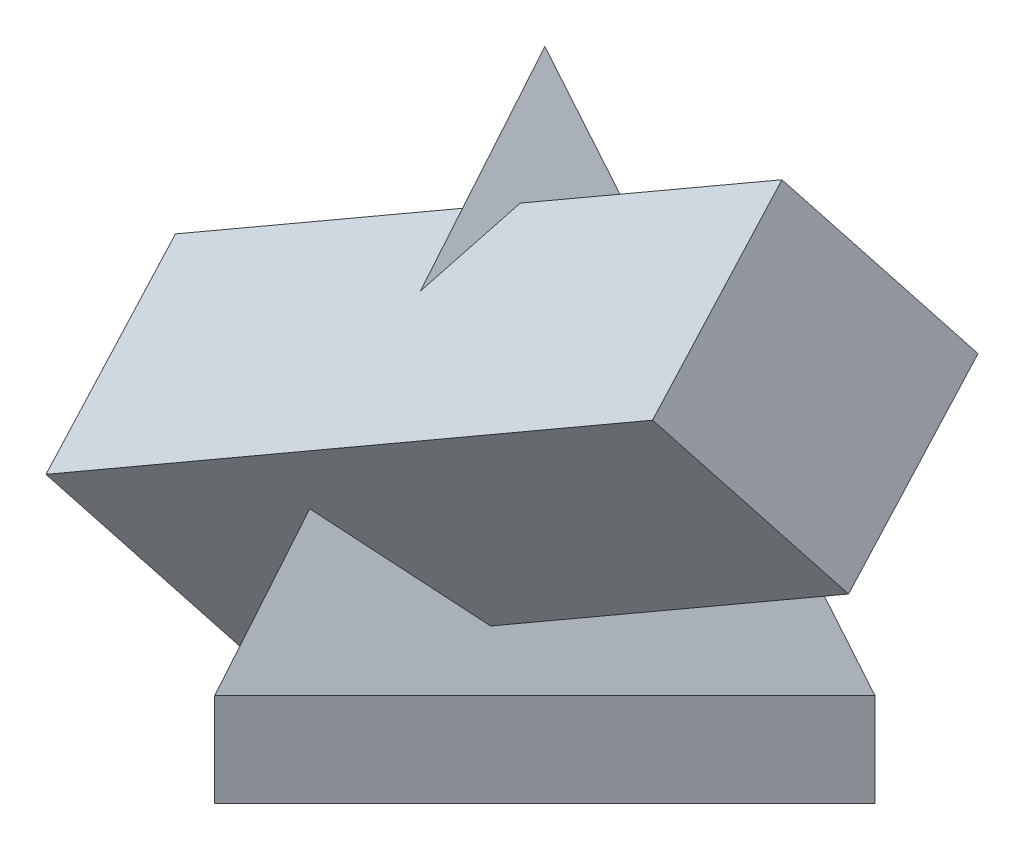
ISO-10303-21;
HEADER;
FILE_DESCRIPTION(('STEP AP214'),'2;1');
FILE_NAME('part.step','',(''),(''),'','','');
FILE_SCHEMA(('AUTOMOTIVE_DESIGN { 1 0 10303 214 1 1 1 1 }'));
ENDSEC;
DATA;
#1=APPLICATION_CONTEXT('core data for automotive mechanical design processes');
#2=APPLICATION_PROTOCOL_DEFINITION('international standard','automotive_design',2000,#1);
#3=PRODUCT_CONTEXT('',#1,'mechanical');
#4=PRODUCT('Part','Part','',(#3));
#5=PRODUCT_RELATED_PRODUCT_CATEGORY('part','',(#4));
#6=PRODUCT_DEFINITION_FORMATION('','',#4);
#7=PRODUCT_DEFINITION_CONTEXT('part definition',#1,'design');
#8=PRODUCT_DEFINITION('design','',#6,#7);
#9=PRODUCT_DEFINITION_SHAPE('','',#8);
#10=(LENGTH_UNIT() NAMED_UNIT(*) SI_UNIT(.MILLI.,.METRE.));
#11=(NAMED_UNIT(*) PLANE_ANGLE_UNIT() SI_UNIT($,.RADIAN.));
#12=(NAMED_UNIT(*) SI_UNIT($,.STERADIAN.) SOLID_ANGLE_UNIT());
#13=UNCERTAINTY_MEASURE_WITH_UNIT(LENGTH_MEASURE(1.E-05),#10,'distance_accuracy_value','');
#14=(GEOMETRIC_REPRESENTATION_CONTEXT(3) GLOBAL_UNCERTAINTY_ASSIGNED_CONTEXT((#13)) GLOBAL_UNIT_ASSIGNED_CONTEXT((#10,
#11,#12)) REPRESENTATION_CONTEXT('',''));
#15=CARTESIAN_POINT('',(0.,0.,0.));
#16=DIRECTION('',(0.,0.,1.));
#17=DIRECTION('',(1.,0.,0.));
#18=AXIS2_PLACEMENT_3D('',#15,#16,#17);
#19=CARTESIAN_POINT('',(25.881904510252,20.,96.5925826289068));
#20=DIRECTION('',(0.965925826289069,0.,-0.25881904510252));
#21=DIRECTION('',(-0.25881904510252,0.,-0.965925826289069));
#22=AXIS2_PLACEMENT_3D('',#19,#20,#21);
#23=PLANE('',#22);
#24=DIRECTION('',(0.11208878178138,0.901356545467851,0.418321028566611));
#25=VECTOR('',#24,1.);
#26=CARTESIAN_POINT('',(19.9794160731373,30.9574176679873,74.5641958905069));
#27=LINE('',#26,#25);
#28=CARTESIAN_POINT('',(17.377321752701,10.0328013917167,64.853047680552));
#29=VERTEX_POINT('',#28);
#30=CARTESIAN_POINT('',(18.6167992440367,20.,69.4788406530551));
#31=VERTEX_POINT('',#30);
#32=EDGE_CURVE('E202',#29,#31,#27,.T.);
#33=ORIENTED_EDGE('',*,*,#32,.F.);
#34=DIRECTION('',(0.23200098320511,-0.443280474379202,0.865839456727407));
#35=VECTOR('',#34,1.);
#36=CARTESIAN_POINT('',(23.185732873882,-1.06523449423572,86.5303330960477));
#37=LINE('',#36,#35);
#38=CARTESIAN_POINT('',(12.1607602062878,20.,45.3845749485279));
#39=VERTEX_POINT('',#38);
#40=EDGE_CURVE('E142',#39,#29,#37,.T.);
#41=ORIENTED_EDGE('',*,*,#40,.F.);
#42=DIRECTION('',(0.25881904510252,0.,0.965925826289068));
#43=VECTOR('',#42,1.);
#44=CARTESIAN_POINT('',(0.,20.,0.));
#45=LINE('',#44,#43);
#46=CARTESIAN_POINT('',(0.,20.,0.));
#47=VERTEX_POINT('',#46);
#48=EDGE_CURVE('E233',#47,#39,#45,.T.);
#49=ORIENTED_EDGE('',*,*,#48,.F.);
#50=DIRECTION('',(0.,-1.,0.));
#51=VECTOR('',#50,1.);
#52=CARTESIAN_POINT('',(0.,20.,0.));
#53=LINE('',#52,#51);
#54=CARTESIAN_POINT('',(0.,0.,0.));
#55=VERTEX_POINT('',#54);
#56=EDGE_CURVE('E222',#47,#55,#53,.T.);
#57=ORIENTED_EDGE('',*,*,#56,.T.);
#58=DIRECTION('',(0.25881904510252,0.,0.965925826289068));
#59=VECTOR('',#58,1.);
#60=CARTESIAN_POINT('',(25.881904510252,0.,96.5925826289068));
#61=LINE('',#60,#59);
#62=CARTESIAN_POINT('',(25.881904510252,0.,96.5925826289068));
#63=VERTEX_POINT('',#62);
#64=EDGE_CURVE('E207',#55,#63,#61,.T.);
#65=ORIENTED_EDGE('',*,*,#64,.T.);
#66=DIRECTION('',(0.,-1.,0.));
#67=VECTOR('',#66,1.);
#68=CARTESIAN_POINT('',(25.881904510252,20.,96.5925826289068));
#69=LINE('',#68,#67);
#70=CARTESIAN_POINT('',(25.881904510252,20.,96.5925826289068));
#71=VERTEX_POINT('',#70);
#72=EDGE_CURVE('E229',#71,#63,#69,.T.);
#73=ORIENTED_EDGE('',*,*,#72,.F.);
#74=EDGE_CURVE('E221',#31,#71,#45,.T.);
#75=ORIENTED_EDGE('',*,*,#74,.F.);
#76=EDGE_LOOP('',(#33,#41,#49,#57,#65,#73,#75));
#77=FACE_BOUND('',#76,.T.);
#78=ADVANCED_FACE('F35',(#77),#23,.F.);
#79=CARTESIAN_POINT('',(0.,20.,0.));
#80=DIRECTION('',(-0.928031515657931,0.277350098112615,0.248665295171173));
#81=DIRECTION('',(-0.286344323664977,-0.958126780914116,0.));
#82=AXIS2_PLACEMENT_3D('',#79,#80,#81);
#83=PLANE('',#82);
#84=DIRECTION('',(-0.129409522551261,-0.866025403784439,0.482962913144534));
#85=VECTOR('',#84,1.);
#86=CARTESIAN_POINT('',(40.8248290463863,120.,40.8248290463864));
#87=LINE('',#86,#85);
#88=CARTESIAN_POINT('',(30.1843202317546,48.7923271719581,80.5357485609762));
#89=VERTEX_POINT('',#88);
#90=EDGE_CURVE('E208',#89,#71,#87,.T.);
#91=ORIENTED_EDGE('',*,*,#90,.F.);
#92=DIRECTION('',(-0.35116663614666,-0.874077055105075,-0.335665451597688));
#93=VECTOR('',#92,1.);
#94=CARTESIAN_POINT('',(8.13122855256221,-6.09928110389285,59.4561236317736));
#95=LINE('',#94,#93);
#96=EDGE_CURVE('E199',#89,#31,#95,.T.);
#97=ORIENTED_EDGE('',*,*,#96,.T.);
#98=ORIENTED_EDGE('',*,*,#74,.T.);
#99=EDGE_LOOP('',(#91,#97,#98));
#100=FACE_BOUND('',#99,.T.);
#101=ADVANCED_FACE('F286',(#100),#83,.T.);
#102=ORIENTED_EDGE('',*,*,#48,.T.);
#103=DIRECTION('',(-0.0704392001564839,0.524849080779374,-0.848275757926844));
#104=VECTOR('',#103,1.);
#105=CARTESIAN_POINT('',(9.38860935813983,40.6555557303314,12.0004882954116));
#106=LINE('',#105,#104);
#107=CARTESIAN_POINT('',(10.5412956704333,32.0667820064651,25.8819045102521));
#108=VERTEX_POINT('',#107);
#109=EDGE_CURVE('E192',#39,#108,#106,.T.);
#110=ORIENTED_EDGE('',*,*,#109,.T.);
#111=DIRECTION('',(0.35116663614666,0.874077055105075,0.335665451597688));
#112=VECTOR('',#111,1.);
#113=CARTESIAN_POINT('',(2.48668845002809,12.0183302614663,18.1828434612117));
#114=LINE('',#113,#112);
#115=CARTESIAN_POINT('',(34.0803559928218,90.6570648200672,48.3819045102519));
#116=VERTEX_POINT('',#115);
#117=EDGE_CURVE('E186',#108,#116,#114,.T.);
#118=ORIENTED_EDGE('',*,*,#117,.T.);
#119=DIRECTION('',(0.0704392001564839,-0.524849080779374,0.848275757926844));
#120=VECTOR('',#119,1.);
#121=CARTESIAN_POINT('',(33.6325391853755,93.9937898144396,42.988996287203));
#122=LINE('',#121,#120);
#123=CARTESIAN_POINT('',(35.196930122335,82.3373663539413,61.8284337708078));
#124=VERTEX_POINT('',#123);
#125=EDGE_CURVE('E196',#116,#124,#122,.T.);
#126=ORIENTED_EDGE('',*,*,#125,.T.);
#127=CARTESIAN_POINT('',(40.8248290463863,120.,40.8248290463864));
#128=VERTEX_POINT('',#127);
#129=EDGE_CURVE('E204',#128,#124,#87,.T.);
#130=ORIENTED_EDGE('',*,*,#129,.F.);
#131=DIRECTION('',(-0.353553390593274,-0.866025403784438,-0.353553390593274));
#132=VECTOR('',#131,1.);
#133=CARTESIAN_POINT('',(40.8248290463863,120.,40.8248290463864));
#134=LINE('',#133,#132);
#135=EDGE_CURVE('E212',#128,#47,#134,.T.);
#136=ORIENTED_EDGE('',*,*,#135,.T.);
#137=EDGE_LOOP('',(#102,#110,#118,#126,#130,#136));
#138=FACE_BOUND('',#137,.T.);
#139=ADVANCED_FACE('F254',(#138),#83,.T.);
#140=CARTESIAN_POINT('',(25.881904510252,20.,96.5925826289069));
#141=DIRECTION('',(0.679366220486757,0.277350098112614,0.679366220486758));
#142=DIRECTION('',(0.707106781186548,0.,-0.707106781186547));
#143=AXIS2_PLACEMENT_3D('',#140,#141,#142);
#144=PLANE('',#143);
#145=DIRECTION('',(-0.383374556254765,-0.655264979104015,0.650885363774817));
#146=VECTOR('',#145,1.);
#147=CARTESIAN_POINT('',(38.6000461673175,5.71765669158888,89.7051832113182));
#148=LINE('',#147,#146);
#149=CARTESIAN_POINT('',(72.369252081888,63.4360880453524,32.372526368318));
#150=VERTEX_POINT('',#149);
#151=CARTESIAN_POINT('',(53.2380714807688,30.7370149005585,64.853047680552));
#152=VERTEX_POINT('',#151);
#153=EDGE_CURVE('E189',#150,#152,#148,.T.);
#154=ORIENTED_EDGE('',*,*,#153,.T.);
#155=DIRECTION('',(-0.694019696453443,0.543544614783883,0.472118536677084));
#156=VECTOR('',#155,1.);
#157=CARTESIAN_POINT('',(33.7121778956737,46.029368073324,78.135864225696));
#158=LINE('',#157,#156);
#159=EDGE_CURVE('E12',#152,#89,#158,.T.);
#160=ORIENTED_EDGE('',*,*,#159,.T.);
#161=ORIENTED_EDGE('',*,*,#90,.T.);
#162=DIRECTION('',(0.707106781186548,0.,-0.707106781186547));
#163=VECTOR('',#162,1.);
#164=CARTESIAN_POINT('',(25.881904510252,20.,96.5925826289069));
#165=LINE('',#164,#163);
#166=CARTESIAN_POINT('',(96.5925826289068,19.9999999999999,25.8819045102521));
#167=VERTEX_POINT('',#166);
#168=EDGE_CURVE('E236',#71,#167,#165,.T.);
#169=ORIENTED_EDGE('',*,*,#168,.T.);
#170=DIRECTION('',(0.482962913144534,-0.866025403784439,-0.12940952255126));
#171=VECTOR('',#170,1.);
#172=CARTESIAN_POINT('',(40.8248290463863,120.,40.8248290463864));
#173=LINE('',#172,#171);
#174=EDGE_CURVE('E57',#150,#167,#173,.T.);
#175=ORIENTED_EDGE('',*,*,#174,.F.);
#176=EDGE_LOOP('',(#154,#160,#161,#169,#175));
#177=FACE_BOUND('',#176,.T.);
#178=ADVANCED_FACE('F268',(#177),#144,.T.);
#179=DIRECTION('',(0.383374556254765,0.655264979104015,-0.650885363774817));
#180=VECTOR('',#179,1.);
#181=CARTESIAN_POINT('',(9.49315647576327,38.4043968163839,105.467767126088));
#182=LINE('',#181,#180);
#183=CARTESIAN_POINT('',(43.1169994238408,95.8743733375366,48.3819045102519));
#184=VERTEX_POINT('',#183);
#185=EDGE_CURVE('E42',#124,#184,#182,.T.);
#186=ORIENTED_EDGE('',*,*,#185,.T.);
#187=DIRECTION('',(0.694019696453444,-0.543544614783882,-0.472118536677084));
#188=VECTOR('',#187,1.);
#189=CARTESIAN_POINT('',(47.6409368903309,92.3313012027032,45.3044201857977));
#190=LINE('',#189,#188);
#191=CARTESIAN_POINT('',(62.9348804105811,80.3533405169743,34.9004586387397));
#192=VERTEX_POINT('',#191);
#193=EDGE_CURVE('E183',#184,#192,#190,.T.);
#194=ORIENTED_EDGE('',*,*,#193,.T.);
#195=EDGE_CURVE('E209',#128,#192,#173,.T.);
#196=ORIENTED_EDGE('',*,*,#195,.F.);
#197=ORIENTED_EDGE('',*,*,#129,.T.);
#198=EDGE_LOOP('',(#186,#194,#196,#197));
#199=FACE_BOUND('',#198,.T.);
#200=ADVANCED_FACE('F245',(#199),#144,.T.);
#201=CARTESIAN_POINT('',(96.5925826289068,20.,25.8819045102521));
#202=DIRECTION('',(0.248665295171174,0.277350098112615,-0.928031515657931));
#203=DIRECTION('',(0.,0.958126780914116,0.286344323664977));
#204=AXIS2_PLACEMENT_3D('',#201,#202,#203);
#205=PLANE('',#204);
#206=DIRECTION('',(-0.318511750690144,-0.88142616367329,-0.348766659336133));
#207=VECTOR('',#206,1.);
#208=CARTESIAN_POINT('',(48.4037339015588,40.1409066162794,18.9890223627014));
#209=LINE('',#208,#207);
#210=CARTESIAN_POINT('',(54.6986703622176,57.5610541714739,25.8819045102521));
#211=VERTEX_POINT('',#210);
#212=EDGE_CURVE('E232',#192,#211,#209,.T.);
#213=ORIENTED_EDGE('',*,*,#212,.T.);
#214=DIRECTION('',(0.896056550347519,0.297916767524538,0.3291325845416));
#215=VECTOR('',#214,1.);
#216=CARTESIAN_POINT('',(78.309085431027,65.4109365639238,34.5543001650614));
#217=LINE('',#216,#215);
#218=EDGE_CURVE('E242',#211,#150,#217,.T.);
#219=ORIENTED_EDGE('',*,*,#218,.T.);
#220=ORIENTED_EDGE('',*,*,#174,.T.);
#221=DIRECTION('',(-0.965925826289068,0.,-0.258819045102521));
#222=VECTOR('',#221,1.);
#223=CARTESIAN_POINT('',(96.5925826289069,20.,25.8819045102521));
#224=LINE('',#223,#222);
#225=EDGE_CURVE('E226',#167,#47,#224,.T.);
#226=ORIENTED_EDGE('',*,*,#225,.T.);
#227=ORIENTED_EDGE('',*,*,#135,.F.);
#228=ORIENTED_EDGE('',*,*,#195,.T.);
#229=EDGE_LOOP('',(#213,#219,#220,#226,#227,#228));
#230=FACE_BOUND('',#229,.T.);
#231=ADVANCED_FACE('F260',(#230),#205,.T.);
#232=CARTESIAN_POINT('',(96.5925826289068,20.,25.8819045102521));
#233=DIRECTION('',(-0.707106781186547,0.,-0.707106781186548));
#234=DIRECTION('',(-0.707106781186548,0.,0.707106781186547));
#235=AXIS2_PLACEMENT_3D('',#232,#233,#234);
#236=PLANE('',#235);
#237=DIRECTION('',(0.707106781186548,0.,-0.707106781186547));
#238=VECTOR('',#237,1.);
#239=CARTESIAN_POINT('',(96.5925826289068,0.,25.8819045102521));
#240=LINE('',#239,#238);
#241=CARTESIAN_POINT('',(96.5925826289068,0.,25.8819045102521));
#242=VERTEX_POINT('',#241);
#243=EDGE_CURVE('E217',#63,#242,#240,.T.);
#244=ORIENTED_EDGE('',*,*,#243,.T.);
#245=DIRECTION('',(0.,-1.,0.));
#246=VECTOR('',#245,1.);
#247=CARTESIAN_POINT('',(96.5925826289068,20.,25.8819045102521));
#248=LINE('',#247,#246);
#249=EDGE_CURVE('E225',#167,#242,#248,.T.);
#250=ORIENTED_EDGE('',*,*,#249,.F.);
#251=ORIENTED_EDGE('',*,*,#168,.F.);
#252=ORIENTED_EDGE('',*,*,#72,.T.);
#253=EDGE_LOOP('',(#244,#250,#251,#252));
#254=FACE_BOUND('',#253,.T.);
#255=ADVANCED_FACE('F272',(#254),#236,.F.);
#256=CARTESIAN_POINT('',(0.,20.,0.));
#257=DIRECTION('',(-0.258819045102521,0.,0.965925826289068));
#258=DIRECTION('',(0.965925826289068,0.,0.258819045102521));
#259=AXIS2_PLACEMENT_3D('',#256,#257,#258);
#260=PLANE('',#259);
#261=DIRECTION('',(-0.965925826289068,0.,-0.258819045102521));
#262=VECTOR('',#261,1.);
#263=CARTESIAN_POINT('',(0.,0.,0.));
#264=LINE('',#263,#262);
#265=EDGE_CURVE('E219',#242,#55,#264,.T.);
#266=ORIENTED_EDGE('',*,*,#265,.T.);
#267=ORIENTED_EDGE('',*,*,#56,.F.);
#268=ORIENTED_EDGE('',*,*,#225,.F.);
#269=ORIENTED_EDGE('',*,*,#249,.T.);
#270=EDGE_LOOP('',(#266,#267,#268,#269));
#271=FACE_BOUND('',#270,.T.);
#272=ADVANCED_FACE('F263',(#271),#260,.F.);
#273=CARTESIAN_POINT('',(25.881904510252,0.,96.5925826289069));
#274=DIRECTION('',(0.,1.,0.));
#275=DIRECTION('',(0.,0.,1.));
#276=AXIS2_PLACEMENT_3D('',#273,#274,#275);
#277=PLANE('',#276);
#278=ORIENTED_EDGE('',*,*,#64,.F.);
#279=ORIENTED_EDGE('',*,*,#265,.F.);
#280=ORIENTED_EDGE('',*,*,#243,.F.);
#281=EDGE_LOOP('',(#278,#279,#280));
#282=FACE_BOUND('',#281,.T.);
#283=ADVANCED_FACE('F275',(#282),#277,.F.);
#284=CARTESIAN_POINT('',(110.418238982516,108.75,87.3530476805518));
#285=DIRECTION('',(-0.249999999999998,0.433012701892215,-0.866025403784442));
#286=DIRECTION('',(0.,0.894427190999919,0.447213595499953));
#287=AXIS2_PLACEMENT_3D('',#284,#285,#286);
#288=PLANE('',#287);
#289=DIRECTION('',(-0.866025403784438,-0.500000000000001,0.));
#290=VECTOR('',#289,1.);
#291=CARTESIAN_POINT('',(129.903810567666,75.0000000000001,64.853047680552));
#292=LINE('',#291,#290);
#293=CARTESIAN_POINT('',(0.,0.,64.853047680552));
#294=VERTEX_POINT('',#293);
#295=EDGE_CURVE('E135',#29,#294,#292,.T.);
#296=ORIENTED_EDGE('',*,*,#295,.F.);
#297=ORIENTED_EDGE('',*,*,#32,.T.);
#298=ORIENTED_EDGE('',*,*,#96,.F.);
#299=ORIENTED_EDGE('',*,*,#159,.F.);
#300=CARTESIAN_POINT('',(129.903810567666,75.0000000000001,64.853047680552));
#301=VERTEX_POINT('',#300);
#302=EDGE_CURVE('E146',#301,#152,#292,.T.);
#303=ORIENTED_EDGE('',*,*,#302,.F.);
#304=DIRECTION('',(0.433012701892221,-0.750000000000002,-0.499999999999995));
#305=VECTOR('',#304,1.);
#306=CARTESIAN_POINT('',(110.418238982516,108.75,87.3530476805518));
#307=LINE('',#306,#305);
#308=CARTESIAN_POINT('',(110.418238982516,108.75,87.3530476805518));
#309=VERTEX_POINT('',#308);
#310=EDGE_CURVE('E166',#309,#301,#307,.T.);
#311=ORIENTED_EDGE('',*,*,#310,.F.);
#312=DIRECTION('',(-0.866025403784438,-0.500000000000001,0.));
#313=VECTOR('',#312,1.);
#314=CARTESIAN_POINT('',(110.418238982516,108.75,87.3530476805518));
#315=LINE('',#314,#313);
#316=CARTESIAN_POINT('',(-19.48557158515,33.7500000000001,87.3530476805518));
#317=VERTEX_POINT('',#316);
#318=EDGE_CURVE('E160',#309,#317,#315,.T.);
#319=ORIENTED_EDGE('',*,*,#318,.T.);
#320=DIRECTION('',(0.433012701892221,-0.750000000000002,-0.499999999999995));
#321=VECTOR('',#320,1.);
#322=CARTESIAN_POINT('',(-19.48557158515,33.7500000000001,87.3530476805518));
#323=LINE('',#322,#321);
#324=EDGE_CURVE('E152',#317,#294,#323,.T.);
#325=ORIENTED_EDGE('',*,*,#324,.T.);
#326=EDGE_LOOP('',(#296,#297,#298,#299,#303,#311,#319,#325));
#327=FACE_BOUND('',#326,.T.);
#328=ADVANCED_FACE('F157',(#327),#288,.F.);
#329=CARTESIAN_POINT('',(129.903810567666,75.0000000000001,64.853047680552));
#330=DIRECTION('',(-0.433012701892221,0.750000000000002,0.499999999999995));
#331=DIRECTION('',(0.,-0.554700196225224,0.832050294337847));
#332=AXIS2_PLACEMENT_3D('',#329,#330,#331);
#333=PLANE('',#332);
#334=ORIENTED_EDGE('',*,*,#109,.F.);
#335=ORIENTED_EDGE('',*,*,#40,.T.);
#336=ORIENTED_EDGE('',*,*,#295,.T.);
#337=DIRECTION('',(-0.249999999999998,0.433012701892215,-0.866025403784442));
#338=VECTOR('',#337,1.);
#339=CARTESIAN_POINT('',(0.,0.,64.853047680552));
#340=LINE('',#339,#338);
#341=CARTESIAN_POINT('',(-11.2499999999999,19.4855715851497,25.8819045102521));
#342=VERTEX_POINT('',#341);
#343=EDGE_CURVE('E139',#294,#342,#340,.T.);
#344=ORIENTED_EDGE('',*,*,#343,.T.);
#345=DIRECTION('',(-0.866025403784438,-0.500000000000001,0.));
#346=VECTOR('',#345,1.);
#347=CARTESIAN_POINT('',(118.653810567666,94.4855715851498,25.8819045102521));
#348=LINE('',#347,#346);
#349=EDGE_CURVE('E180',#108,#342,#348,.T.);
#350=ORIENTED_EDGE('',*,*,#349,.F.);
#351=EDGE_LOOP('',(#334,#335,#336,#344,#350));
#352=FACE_BOUND('',#351,.T.);
#353=ADVANCED_FACE('F137',(#352),#333,.F.);
#354=CARTESIAN_POINT('',(118.653810567666,94.4855715851498,25.8819045102521));
#355=DIRECTION('',(0.249999999999998,-0.433012701892215,0.866025403784442));
#356=DIRECTION('',(0.,-0.894427190999918,-0.447213595499953));
#357=AXIS2_PLACEMENT_3D('',#354,#355,#356);
#358=PLANE('',#357);
#359=ORIENTED_EDGE('',*,*,#117,.F.);
#360=ORIENTED_EDGE('',*,*,#349,.T.);
#361=DIRECTION('',(-0.433012701892221,0.750000000000002,0.499999999999995));
#362=VECTOR('',#361,1.);
#363=CARTESIAN_POINT('',(-11.2499999999999,19.4855715851497,25.8819045102521));
#364=LINE('',#363,#362);
#365=CARTESIAN_POINT('',(-30.7355715851499,53.2355715851498,48.3819045102519));
#366=VERTEX_POINT('',#365);
#367=EDGE_CURVE('E154',#342,#366,#364,.T.);
#368=ORIENTED_EDGE('',*,*,#367,.T.);
#369=DIRECTION('',(-0.866025403784438,-0.500000000000001,0.));
#370=VECTOR('',#369,1.);
#371=CARTESIAN_POINT('',(99.1682389825159,128.23557158515,48.3819045102519));
#372=LINE('',#371,#370);
#373=EDGE_CURVE('E176',#116,#366,#372,.T.);
#374=ORIENTED_EDGE('',*,*,#373,.F.);
#375=EDGE_LOOP('',(#359,#360,#368,#374));
#376=FACE_BOUND('',#375,.T.);
#377=ADVANCED_FACE('F256',(#376),#358,.F.);
#378=ORIENTED_EDGE('',*,*,#153,.F.);
#379=ORIENTED_EDGE('',*,*,#218,.F.);
#380=CARTESIAN_POINT('',(118.653810567666,94.4855715851498,25.8819045102521));
#381=VERTEX_POINT('',#380);
#382=EDGE_CURVE('E49',#381,#211,#348,.T.);
#383=ORIENTED_EDGE('',*,*,#382,.F.);
#384=DIRECTION('',(-0.249999999999998,0.433012701892215,-0.866025403784442));
#385=VECTOR('',#384,1.);
#386=CARTESIAN_POINT('',(129.903810567666,75.0000000000001,64.853047680552));
#387=LINE('',#386,#385);
#388=EDGE_CURVE('E169',#301,#381,#387,.T.);
#389=ORIENTED_EDGE('',*,*,#388,.F.);
#390=ORIENTED_EDGE('',*,*,#302,.T.);
#391=EDGE_LOOP('',(#378,#379,#383,#389,#390));
#392=FACE_BOUND('',#391,.T.);
#393=ADVANCED_FACE('F299',(#392),#333,.F.);
#394=ORIENTED_EDGE('',*,*,#193,.F.);
#395=CARTESIAN_POINT('',(99.1682389825159,128.23557158515,48.3819045102519));
#396=VERTEX_POINT('',#395);
#397=EDGE_CURVE('E177',#396,#184,#372,.T.);
#398=ORIENTED_EDGE('',*,*,#397,.F.);
#399=DIRECTION('',(-0.433012701892221,0.750000000000002,0.499999999999995));
#400=VECTOR('',#399,1.);
#401=CARTESIAN_POINT('',(118.653810567666,94.4855715851498,25.8819045102521));
#402=LINE('',#401,#400);
#403=EDGE_CURVE('E171',#381,#396,#402,.T.);
#404=ORIENTED_EDGE('',*,*,#403,.F.);
#405=ORIENTED_EDGE('',*,*,#382,.T.);
#406=ORIENTED_EDGE('',*,*,#212,.F.);
#407=EDGE_LOOP('',(#394,#398,#404,#405,#406));
#408=FACE_BOUND('',#407,.T.);
#409=ADVANCED_FACE('F302',(#408),#358,.F.);
#410=CARTESIAN_POINT('',(99.1682389825159,128.23557158515,48.3819045102519));
#411=DIRECTION('',(0.433012701892221,-0.750000000000002,-0.499999999999995));
#412=DIRECTION('',(0.,0.554700196225224,-0.832050294337847));
#413=AXIS2_PLACEMENT_3D('',#410,#411,#412);
#414=PLANE('',#413);
#415=ORIENTED_EDGE('',*,*,#125,.F.);
#416=ORIENTED_EDGE('',*,*,#373,.T.);
#417=DIRECTION('',(0.249999999999998,-0.433012701892215,0.866025403784442));
#418=VECTOR('',#417,1.);
#419=CARTESIAN_POINT('',(-30.7355715851499,53.2355715851498,48.3819045102519));
#420=LINE('',#419,#418);
#421=EDGE_CURVE('E164',#366,#317,#420,.T.);
#422=ORIENTED_EDGE('',*,*,#421,.T.);
#423=ORIENTED_EDGE('',*,*,#318,.F.);
#424=DIRECTION('',(0.249999999999998,-0.433012701892215,0.866025403784442));
#425=VECTOR('',#424,1.);
#426=CARTESIAN_POINT('',(99.1682389825159,128.23557158515,48.3819045102519));
#427=LINE('',#426,#425);
#428=EDGE_CURVE('E173',#396,#309,#427,.T.);
#429=ORIENTED_EDGE('',*,*,#428,.F.);
#430=ORIENTED_EDGE('',*,*,#397,.T.);
#431=ORIENTED_EDGE('',*,*,#185,.F.);
#432=EDGE_LOOP('',(#415,#416,#422,#423,#429,#430,#431));
#433=FACE_BOUND('',#432,.T.);
#434=ADVANCED_FACE('F249',(#433),#414,.F.);
#435=CARTESIAN_POINT('',(110.418238982516,108.75,87.3530476805518));
#436=DIRECTION('',(-0.866025403784438,-0.500000000000001,0.));
#437=DIRECTION('',(0.500000000000001,-0.866025403784438,0.));
#438=AXIS2_PLACEMENT_3D('',#435,#436,#437);
#439=PLANE('',#438);
#440=ORIENTED_EDGE('',*,*,#310,.T.);
#441=ORIENTED_EDGE('',*,*,#388,.T.);
#442=ORIENTED_EDGE('',*,*,#403,.T.);
#443=ORIENTED_EDGE('',*,*,#428,.T.);
#444=EDGE_LOOP('',(#440,#441,#442,#443));
#445=FACE_BOUND('',#444,.T.);
#446=ADVANCED_FACE('F308',(#445),#439,.F.);
#447=CARTESIAN_POINT('',(-19.48557158515,33.7500000000001,87.3530476805518));
#448=DIRECTION('',(-0.866025403784438,-0.500000000000001,0.));
#449=DIRECTION('',(0.500000000000001,-0.866025403784438,0.));
#450=AXIS2_PLACEMENT_3D('',#447,#448,#449);
#451=PLANE('',#450);
#452=ORIENTED_EDGE('',*,*,#324,.F.);
#453=ORIENTED_EDGE('',*,*,#421,.F.);
#454=ORIENTED_EDGE('',*,*,#367,.F.);
#455=ORIENTED_EDGE('',*,*,#343,.F.);
#456=EDGE_LOOP('',(#452,#453,#454,#455));
#457=FACE_BOUND('',#456,.T.);
#458=ADVANCED_FACE('F150',(#457),#451,.T.);
#459=CLOSED_SHELL('',(#78,#101,#139,#178,#200,#231,#255,#272,#283,#328,#353,#377,#393,#409,#434,
#446,#458));
#460=MANIFOLD_SOLID_BREP('B2',#459);
#461=ADVANCED_BREP_SHAPE_REPRESENTATION('',(#18,#460),#14);
#462=SHAPE_DEFINITION_REPRESENTATION(#9,#461);
ENDSEC;
END-ISO-10303-21;
